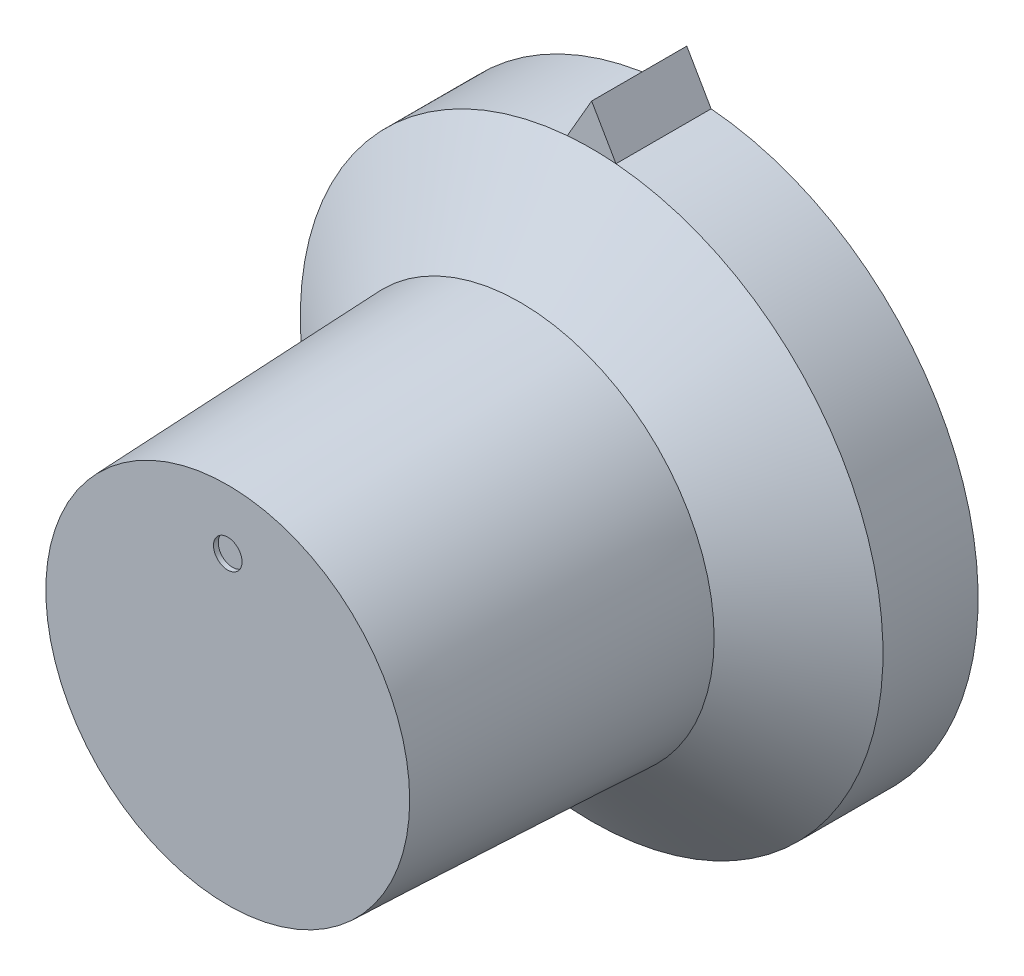
ISO-10303-21;
HEADER;
FILE_DESCRIPTION(('STEP AP214'),'2;1');
FILE_NAME('part.step','',(''),(''),'','','');
FILE_SCHEMA(('AUTOMOTIVE_DESIGN { 1 0 10303 214 1 1 1 1 }'));
ENDSEC;
DATA;
#1=APPLICATION_CONTEXT('core data for automotive mechanical design processes');
#2=APPLICATION_PROTOCOL_DEFINITION('international standard','automotive_design',2000,#1);
#3=PRODUCT_CONTEXT('',#1,'mechanical');
#4=PRODUCT('Part','Part','',(#3));
#5=PRODUCT_RELATED_PRODUCT_CATEGORY('part','',(#4));
#6=PRODUCT_DEFINITION_FORMATION('','',#4);
#7=PRODUCT_DEFINITION_CONTEXT('part definition',#1,'design');
#8=PRODUCT_DEFINITION('design','',#6,#7);
#9=PRODUCT_DEFINITION_SHAPE('','',#8);
#10=(LENGTH_UNIT() NAMED_UNIT(*) SI_UNIT(.MILLI.,.METRE.));
#11=(NAMED_UNIT(*) PLANE_ANGLE_UNIT() SI_UNIT($,.RADIAN.));
#12=(NAMED_UNIT(*) SI_UNIT($,.STERADIAN.) SOLID_ANGLE_UNIT());
#13=UNCERTAINTY_MEASURE_WITH_UNIT(LENGTH_MEASURE(1.E-05),#10,'distance_accuracy_value','');
#14=(GEOMETRIC_REPRESENTATION_CONTEXT(3) GLOBAL_UNCERTAINTY_ASSIGNED_CONTEXT((#13)) GLOBAL_UNIT_ASSIGNED_CONTEXT((#10,
#11,#12)) REPRESENTATION_CONTEXT('',''));
#15=CARTESIAN_POINT('',(0.,0.,0.));
#16=DIRECTION('',(0.,0.,1.));
#17=DIRECTION('',(1.,0.,0.));
#18=AXIS2_PLACEMENT_3D('',#15,#16,#17);
#19=CARTESIAN_POINT('',(0.,0.,0.));
#20=DIRECTION('',(0.,0.,-1.));
#21=DIRECTION('',(-1.,0.,0.));
#22=AXIS2_PLACEMENT_3D('',#19,#20,#21);
#23=PLANE('',#22);
#24=CARTESIAN_POINT('',(0.,5.15,0.));
#25=DIRECTION('',(0.,0.,1.));
#26=DIRECTION('',(1.,0.,0.));
#27=AXIS2_PLACEMENT_3D('',#24,#25,#26);
#28=CIRCLE('',#27,0.6);
#29=CARTESIAN_POINT('',(0.6,5.15,0.));
#30=VERTEX_POINT('',#29);
#31=EDGE_CURVE('E165',#30,#30,#28,.T.);
#32=ORIENTED_EDGE('',*,*,#31,.F.);
#33=EDGE_LOOP('',(#32));
#34=FACE_BOUND('',#33,.T.);
#35=CARTESIAN_POINT('',(0.,0.,0.));
#36=DIRECTION('',(0.,0.,1.));
#37=DIRECTION('',(1.,0.,0.));
#38=AXIS2_PLACEMENT_3D('',#35,#36,#37);
#39=CIRCLE('',#38,7.65);
#40=CARTESIAN_POINT('',(7.65,0.,0.));
#41=VERTEX_POINT('',#40);
#42=EDGE_CURVE('E90',#41,#41,#39,.T.);
#43=ORIENTED_EDGE('',*,*,#42,.T.);
#44=EDGE_LOOP('',(#43));
#45=FACE_BOUND('',#44,.T.);
#46=ADVANCED_FACE('F33',(#34,#45),#23,.F.);
#47=CARTESIAN_POINT('',(0.,0.,-19.3));
#48=DIRECTION('',(0.,0.,-1.));
#49=DIRECTION('',(-1.,0.,0.));
#50=AXIS2_PLACEMENT_3D('',#47,#48,#49);
#51=PLANE('',#50);
#52=CARTESIAN_POINT('',(0.,0.,-19.3));
#53=DIRECTION('',(0.,0.,-1.));
#54=DIRECTION('',(-1.,0.,0.));
#55=AXIS2_PLACEMENT_3D('',#52,#53,#54);
#56=CIRCLE('',#55,11.);
#57=CARTESIAN_POINT('',(-11.,0.,-19.3));
#58=VERTEX_POINT('',#57);
#59=EDGE_CURVE('E155',#58,#58,#56,.T.);
#60=ORIENTED_EDGE('',*,*,#59,.F.);
#61=EDGE_LOOP('',(#60));
#62=FACE_BOUND('',#61,.T.);
#63=DIRECTION('',(0.499999999999995,-0.866025403784442,0.));
#64=VECTOR('',#63,1.);
#65=CARTESIAN_POINT('',(0.,13.98,-19.3));
#66=LINE('',#65,#64);
#67=CARTESIAN_POINT('',(0.,13.98,-19.3));
#68=VERTEX_POINT('',#67);
#69=CARTESIAN_POINT('',(1.02354739361517,12.2071639103038,-19.3));
#70=VERTEX_POINT('',#69);
#71=EDGE_CURVE('E75',#68,#70,#66,.T.);
#72=ORIENTED_EDGE('',*,*,#71,.T.);
#73=CARTESIAN_POINT('',(0.,0.,-19.3));
#74=DIRECTION('',(0.,0.,1.));
#75=DIRECTION('',(1.,0.,0.));
#76=AXIS2_PLACEMENT_3D('',#73,#74,#75);
#77=CIRCLE('',#76,12.25);
#78=CARTESIAN_POINT('',(-1.02354739361517,12.2071639103038,-19.3));
#79=VERTEX_POINT('',#78);
#80=EDGE_CURVE('E11',#79,#70,#77,.T.);
#81=ORIENTED_EDGE('',*,*,#80,.F.);
#82=DIRECTION('',(0.499999999999995,0.866025403784442,0.));
#83=VECTOR('',#82,1.);
#84=CARTESIAN_POINT('',(0.,13.98,-19.3));
#85=LINE('',#84,#83);
#86=EDGE_CURVE('E84',#79,#68,#85,.T.);
#87=ORIENTED_EDGE('',*,*,#86,.T.);
#88=EDGE_LOOP('',(#72,#81,#87));
#89=FACE_BOUND('',#88,.T.);
#90=ADVANCED_FACE('F104',(#62,#89),#51,.T.);
#91=CARTESIAN_POINT('',(0.,0.,0.));
#92=DIRECTION('',(0.,0.,1.));
#93=DIRECTION('',(1.,0.,0.));
#94=AXIS2_PLACEMENT_3D('',#91,#92,#93);
#95=CYLINDRICAL_SURFACE('',#94,12.25);
#96=DIRECTION('',(0.,0.,1.));
#97=VECTOR('',#96,1.);
#98=CARTESIAN_POINT('',(1.02354739361517,12.2071639103038,0.));
#99=LINE('',#98,#97);
#100=CARTESIAN_POINT('',(1.02354739361517,12.2071639103038,-15.3));
#101=VERTEX_POINT('',#100);
#102=EDGE_CURVE('E55',#101,#70,#99,.F.);
#103=ORIENTED_EDGE('',*,*,#102,.F.);
#104=CARTESIAN_POINT('',(0.,0.,-15.3));
#105=DIRECTION('',(0.,0.,1.));
#106=DIRECTION('',(1.,0.,0.));
#107=AXIS2_PLACEMENT_3D('',#104,#105,#106);
#108=CIRCLE('',#107,12.25);
#109=CARTESIAN_POINT('',(-1.02354739361517,12.2071639103038,-15.3));
#110=VERTEX_POINT('',#109);
#111=EDGE_CURVE('E95',#110,#101,#108,.T.);
#112=ORIENTED_EDGE('',*,*,#111,.F.);
#113=DIRECTION('',(0.,0.,1.));
#114=VECTOR('',#113,1.);
#115=CARTESIAN_POINT('',(-1.02354739361517,12.2071639103038,0.));
#116=LINE('',#115,#114);
#117=EDGE_CURVE('E72',#79,#110,#116,.T.);
#118=ORIENTED_EDGE('',*,*,#117,.F.);
#119=ORIENTED_EDGE('',*,*,#80,.T.);
#120=EDGE_LOOP('',(#103,#112,#118,#119));
#121=FACE_BOUND('',#120,.T.);
#122=ADVANCED_FACE('F101',(#121),#95,.T.);
#123=CARTESIAN_POINT('',(0.,0.,-12.3));
#124=DIRECTION('',(0.,0.,-1.));
#125=DIRECTION('',(-1.,0.,0.));
#126=AXIS2_PLACEMENT_3D('',#123,#124,#125);
#127=CONICAL_SURFACE('',#126,8.15,0.939105692455927);
#128=EDGE_CURVE('E40',#101,#110,#108,.T.);
#129=ORIENTED_EDGE('',*,*,#128,.T.);
#130=ORIENTED_EDGE('',*,*,#111,.T.);
#131=EDGE_LOOP('',(#129,#130));
#132=FACE_BOUND('',#131,.T.);
#133=CARTESIAN_POINT('',(0.,0.,-12.3));
#134=DIRECTION('',(0.,0.,1.));
#135=DIRECTION('',(1.,0.,0.));
#136=AXIS2_PLACEMENT_3D('',#133,#134,#135);
#137=CIRCLE('',#136,8.15);
#138=CARTESIAN_POINT('',(8.15,0.,-12.3));
#139=VERTEX_POINT('',#138);
#140=EDGE_CURVE('E93',#139,#139,#137,.T.);
#141=ORIENTED_EDGE('',*,*,#140,.F.);
#142=EDGE_LOOP('',(#141));
#143=FACE_BOUND('',#142,.T.);
#144=ADVANCED_FACE('F98',(#132,#143),#127,.T.);
#145=CARTESIAN_POINT('',(0.,0.,0.));
#146=DIRECTION('',(0.,0.,-1.));
#147=DIRECTION('',(-1.,0.,0.));
#148=AXIS2_PLACEMENT_3D('',#145,#146,#147);
#149=CONICAL_SURFACE('',#148,7.65,0.0406280376813731);
#150=ORIENTED_EDGE('',*,*,#140,.T.);
#151=EDGE_LOOP('',(#150));
#152=FACE_BOUND('',#151,.T.);
#153=ORIENTED_EDGE('',*,*,#42,.F.);
#154=EDGE_LOOP('',(#153));
#155=FACE_BOUND('',#154,.T.);
#156=ADVANCED_FACE('F117',(#152,#155),#149,.T.);
#157=CARTESIAN_POINT('',(0.,13.98,-15.3));
#158=DIRECTION('',(0.866025403784442,0.499999999999995,0.));
#159=DIRECTION('',(-0.499999999999995,0.866025403784442,0.));
#160=AXIS2_PLACEMENT_3D('',#157,#158,#159);
#161=PLANE('',#160);
#162=DIRECTION('',(0.499999999999995,-0.866025403784442,0.));
#163=VECTOR('',#162,1.);
#164=CARTESIAN_POINT('',(0.,13.98,-15.3));
#165=LINE('',#164,#163);
#166=CARTESIAN_POINT('',(0.,13.98,-15.3));
#167=VERTEX_POINT('',#166);
#168=EDGE_CURVE('E74',#167,#101,#165,.T.);
#169=ORIENTED_EDGE('',*,*,#168,.T.);
#170=ORIENTED_EDGE('',*,*,#102,.T.);
#171=ORIENTED_EDGE('',*,*,#71,.F.);
#172=DIRECTION('',(0.,0.,-1.));
#173=VECTOR('',#172,1.);
#174=CARTESIAN_POINT('',(0.,13.98,-15.3));
#175=LINE('',#174,#173);
#176=EDGE_CURVE('E70',#167,#68,#175,.T.);
#177=ORIENTED_EDGE('',*,*,#176,.F.);
#178=EDGE_LOOP('',(#169,#170,#171,#177));
#179=FACE_BOUND('',#178,.T.);
#180=ADVANCED_FACE('F77',(#179),#161,.T.);
#181=CARTESIAN_POINT('',(0.,13.98,-15.3));
#182=DIRECTION('',(-0.866025403784442,0.499999999999995,0.));
#183=DIRECTION('',(-0.499999999999995,-0.866025403784442,0.));
#184=AXIS2_PLACEMENT_3D('',#181,#182,#183);
#185=PLANE('',#184);
#186=ORIENTED_EDGE('',*,*,#86,.F.);
#187=ORIENTED_EDGE('',*,*,#117,.T.);
#188=DIRECTION('',(0.499999999999995,0.866025403784442,0.));
#189=VECTOR('',#188,1.);
#190=CARTESIAN_POINT('',(0.,13.98,-15.3));
#191=LINE('',#190,#189);
#192=EDGE_CURVE('E47',#110,#167,#191,.T.);
#193=ORIENTED_EDGE('',*,*,#192,.T.);
#194=ORIENTED_EDGE('',*,*,#176,.T.);
#195=EDGE_LOOP('',(#186,#187,#193,#194));
#196=FACE_BOUND('',#195,.T.);
#197=ADVANCED_FACE('F69',(#196),#185,.T.);
#198=CARTESIAN_POINT('',(0.,0.,-15.3));
#199=DIRECTION('',(0.,0.,-1.));
#200=DIRECTION('',(-1.,0.,0.));
#201=AXIS2_PLACEMENT_3D('',#198,#199,#200);
#202=PLANE('',#201);
#203=ORIENTED_EDGE('',*,*,#128,.F.);
#204=ORIENTED_EDGE('',*,*,#168,.F.);
#205=ORIENTED_EDGE('',*,*,#192,.F.);
#206=EDGE_LOOP('',(#203,#204,#205));
#207=FACE_BOUND('',#206,.T.);
#208=ADVANCED_FACE('F79',(#207),#202,.F.);
#209=CARTESIAN_POINT('',(0.,5.15,-0.2));
#210=DIRECTION('',(0.,0.,1.));
#211=DIRECTION('',(1.,0.,0.));
#212=AXIS2_PLACEMENT_3D('',#209,#210,#211);
#213=CYLINDRICAL_SURFACE('',#212,0.6);
#214=CARTESIAN_POINT('',(0.,5.15,-0.2));
#215=DIRECTION('',(0.,0.,1.));
#216=DIRECTION('',(1.,0.,0.));
#217=AXIS2_PLACEMENT_3D('',#214,#215,#216);
#218=CIRCLE('',#217,0.6);
#219=CARTESIAN_POINT('',(0.6,5.15,-0.2));
#220=VERTEX_POINT('',#219);
#221=EDGE_CURVE('E86',#220,#220,#218,.T.);
#222=ORIENTED_EDGE('',*,*,#221,.F.);
#223=EDGE_LOOP('',(#222));
#224=FACE_BOUND('',#223,.T.);
#225=ORIENTED_EDGE('',*,*,#31,.T.);
#226=EDGE_LOOP('',(#225));
#227=FACE_BOUND('',#226,.T.);
#228=ADVANCED_FACE('F127',(#224,#227),#213,.F.);
#229=CARTESIAN_POINT('',(0.,5.15,-0.2));
#230=DIRECTION('',(0.,0.,1.));
#231=DIRECTION('',(1.,0.,0.));
#232=AXIS2_PLACEMENT_3D('',#229,#230,#231);
#233=PLANE('',#232);
#234=ORIENTED_EDGE('',*,*,#221,.T.);
#235=EDGE_LOOP('',(#234));
#236=FACE_BOUND('',#235,.T.);
#237=ADVANCED_FACE('F130',(#236),#233,.T.);
#238=CARTESIAN_POINT('',(0.,0.,-15.3));
#239=DIRECTION('',(0.,0.,-1.));
#240=DIRECTION('',(-1.,0.,0.));
#241=AXIS2_PLACEMENT_3D('',#238,#239,#240);
#242=CYLINDRICAL_SURFACE('',#241,11.);
#243=CARTESIAN_POINT('',(0.,0.,-15.3));
#244=DIRECTION('',(0.,0.,-1.));
#245=DIRECTION('',(-1.,0.,0.));
#246=AXIS2_PLACEMENT_3D('',#243,#244,#245);
#247=CIRCLE('',#246,11.);
#248=CARTESIAN_POINT('',(-11.,0.,-15.3));
#249=VERTEX_POINT('',#248);
#250=EDGE_CURVE('E159',#249,#249,#247,.T.);
#251=ORIENTED_EDGE('',*,*,#250,.F.);
#252=EDGE_LOOP('',(#251));
#253=FACE_BOUND('',#252,.T.);
#254=ORIENTED_EDGE('',*,*,#59,.T.);
#255=EDGE_LOOP('',(#254));
#256=FACE_BOUND('',#255,.T.);
#257=ADVANCED_FACE('F134',(#253,#256),#242,.F.);
#258=CARTESIAN_POINT('',(0.,0.,-15.3));
#259=DIRECTION('',(0.,0.,-1.));
#260=DIRECTION('',(-1.,0.,0.));
#261=AXIS2_PLACEMENT_3D('',#258,#259,#260);
#262=PLANE('',#261);
#263=CARTESIAN_POINT('',(0.,0.,-15.3));
#264=DIRECTION('',(0.,0.,-1.));
#265=DIRECTION('',(-1.,0.,0.));
#266=AXIS2_PLACEMENT_3D('',#263,#264,#265);
#267=CIRCLE('',#266,3.);
#268=CARTESIAN_POINT('',(-3.,0.,-15.3));
#269=VERTEX_POINT('',#268);
#270=EDGE_CURVE('E156',#269,#269,#267,.T.);
#271=ORIENTED_EDGE('',*,*,#270,.F.);
#272=EDGE_LOOP('',(#271));
#273=FACE_BOUND('',#272,.T.);
#274=ORIENTED_EDGE('',*,*,#250,.T.);
#275=EDGE_LOOP('',(#274));
#276=FACE_BOUND('',#275,.T.);
#277=ADVANCED_FACE('F138',(#273,#276),#262,.T.);
#278=CARTESIAN_POINT('',(0.,0.,-4.30000000000001));
#279=DIRECTION('',(0.,0.,-1.));
#280=DIRECTION('',(-1.,0.,0.));
#281=AXIS2_PLACEMENT_3D('',#278,#279,#280);
#282=CYLINDRICAL_SURFACE('',#281,3.);
#283=CARTESIAN_POINT('',(0.,0.,-4.30000000000001));
#284=DIRECTION('',(0.,0.,-1.));
#285=DIRECTION('',(-1.,0.,0.));
#286=AXIS2_PLACEMENT_3D('',#283,#284,#285);
#287=CIRCLE('',#286,3.);
#288=CARTESIAN_POINT('',(-3.,0.,-4.30000000000001));
#289=VERTEX_POINT('',#288);
#290=EDGE_CURVE('E154',#289,#289,#287,.T.);
#291=ORIENTED_EDGE('',*,*,#290,.F.);
#292=EDGE_LOOP('',(#291));
#293=FACE_BOUND('',#292,.T.);
#294=ORIENTED_EDGE('',*,*,#270,.T.);
#295=EDGE_LOOP('',(#294));
#296=FACE_BOUND('',#295,.T.);
#297=ADVANCED_FACE('F142',(#293,#296),#282,.F.);
#298=CARTESIAN_POINT('',(0.,0.,-4.30000000000001));
#299=DIRECTION('',(0.,0.,-1.));
#300=DIRECTION('',(-1.,0.,0.));
#301=AXIS2_PLACEMENT_3D('',#298,#299,#300);
#302=PLANE('',#301);
#303=ORIENTED_EDGE('',*,*,#290,.T.);
#304=EDGE_LOOP('',(#303));
#305=FACE_BOUND('',#304,.T.);
#306=ADVANCED_FACE('F146',(#305),#302,.T.);
#307=CLOSED_SHELL('',(#46,#90,#122,#144,#156,#180,#197,#208,#228,#237,#257,#277,#297,#306));
#308=MANIFOLD_SOLID_BREP('B2',#307);
#309=ADVANCED_BREP_SHAPE_REPRESENTATION('',(#18,#308),#14);
#310=SHAPE_DEFINITION_REPRESENTATION(#9,#309);
ENDSEC;
END-ISO-10303-21;
